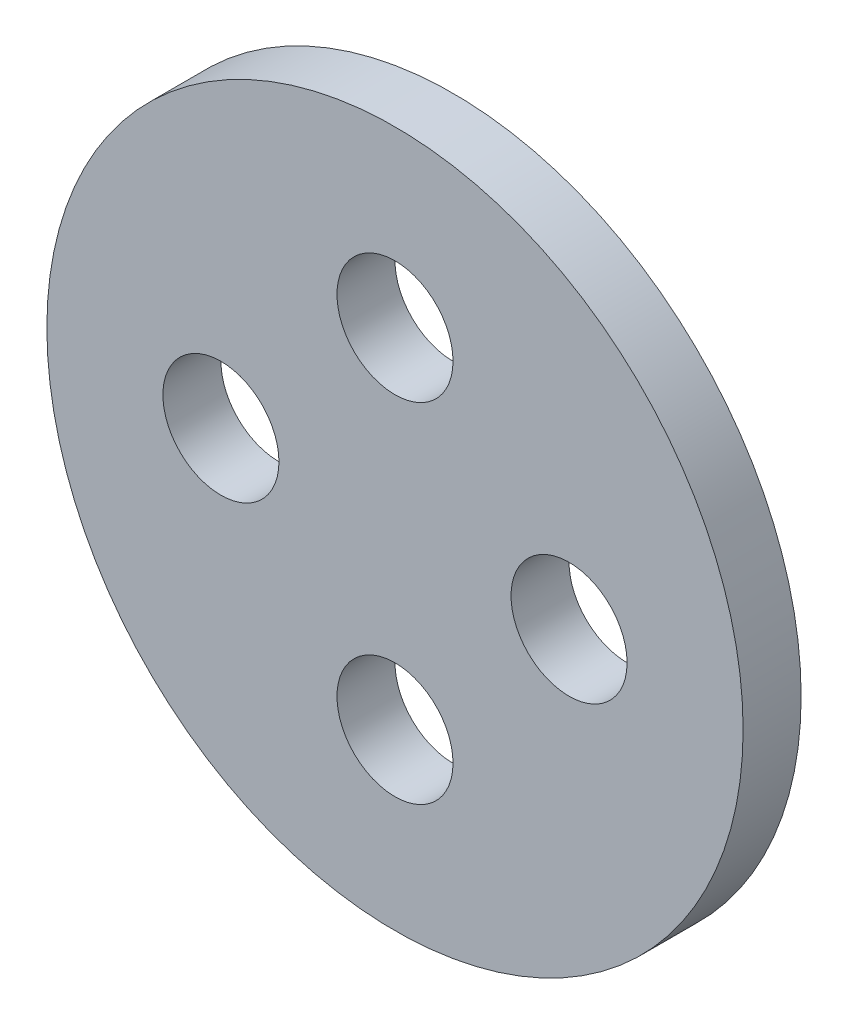
ISO-10303-21;
HEADER;
FILE_DESCRIPTION(('STEP AP214'),'2;1');
FILE_NAME('part.step','',(''),(''),'','','');
FILE_SCHEMA(('AUTOMOTIVE_DESIGN { 1 0 10303 214 1 1 1 1 }'));
ENDSEC;
DATA;
#1=APPLICATION_CONTEXT('core data for automotive mechanical design processes');
#2=APPLICATION_PROTOCOL_DEFINITION('international standard','automotive_design',2000,#1);
#3=PRODUCT_CONTEXT('',#1,'mechanical');
#4=PRODUCT('Part','Part','',(#3));
#5=PRODUCT_RELATED_PRODUCT_CATEGORY('part','',(#4));
#6=PRODUCT_DEFINITION_FORMATION('','',#4);
#7=PRODUCT_DEFINITION_CONTEXT('part definition',#1,'design');
#8=PRODUCT_DEFINITION('design','',#6,#7);
#9=PRODUCT_DEFINITION_SHAPE('','',#8);
#10=(LENGTH_UNIT() NAMED_UNIT(*) SI_UNIT(.MILLI.,.METRE.));
#11=(NAMED_UNIT(*) PLANE_ANGLE_UNIT() SI_UNIT($,.RADIAN.));
#12=(NAMED_UNIT(*) SI_UNIT($,.STERADIAN.) SOLID_ANGLE_UNIT());
#13=UNCERTAINTY_MEASURE_WITH_UNIT(LENGTH_MEASURE(1.E-05),#10,'distance_accuracy_value','');
#14=(GEOMETRIC_REPRESENTATION_CONTEXT(3) GLOBAL_UNCERTAINTY_ASSIGNED_CONTEXT((#13)) GLOBAL_UNIT_ASSIGNED_CONTEXT((#10,
#11,#12)) REPRESENTATION_CONTEXT('',''));
#15=CARTESIAN_POINT('',(0.,0.,0.));
#16=DIRECTION('',(0.,0.,1.));
#17=DIRECTION('',(1.,0.,0.));
#18=AXIS2_PLACEMENT_3D('',#15,#16,#17);
#19=CARTESIAN_POINT('',(0.,0.,1.));
#20=DIRECTION('',(0.,0.,1.));
#21=DIRECTION('',(1.,0.,0.));
#22=AXIS2_PLACEMENT_3D('',#19,#20,#21);
#23=PLANE('',#22);
#24=CARTESIAN_POINT('',(3.95699567787191E-13,-3.,1.));
#25=DIRECTION('',(0.,0.,1.));
#26=DIRECTION('',(1.,0.,0.));
#27=AXIS2_PLACEMENT_3D('',#24,#25,#26);
#28=CIRCLE('',#27,1.);
#29=CARTESIAN_POINT('',(1.0000000000004,-3.,1.));
#30=VERTEX_POINT('',#29);
#31=EDGE_CURVE('E57',#30,#30,#28,.T.);
#32=ORIENTED_EDGE('',*,*,#31,.F.);
#33=EDGE_LOOP('',(#32));
#34=FACE_BOUND('',#33,.T.);
#35=CARTESIAN_POINT('',(0.,3.,1.));
#36=DIRECTION('',(0.,0.,1.));
#37=DIRECTION('',(1.,0.,0.));
#38=AXIS2_PLACEMENT_3D('',#35,#36,#37);
#39=CIRCLE('',#38,1.);
#40=CARTESIAN_POINT('',(1.,3.,1.));
#41=VERTEX_POINT('',#40);
#42=EDGE_CURVE('E46',#41,#41,#39,.T.);
#43=ORIENTED_EDGE('',*,*,#42,.F.);
#44=EDGE_LOOP('',(#43));
#45=FACE_BOUND('',#44,.T.);
#46=CARTESIAN_POINT('',(0.,0.,1.));
#47=DIRECTION('',(0.,0.,1.));
#48=DIRECTION('',(1.,0.,0.));
#49=AXIS2_PLACEMENT_3D('',#46,#47,#48);
#50=CIRCLE('',#49,6.);
#51=CARTESIAN_POINT('',(6.,0.,1.));
#52=VERTEX_POINT('',#51);
#53=EDGE_CURVE('E10',#52,#52,#50,.T.);
#54=ORIENTED_EDGE('',*,*,#53,.T.);
#55=EDGE_LOOP('',(#54));
#56=FACE_BOUND('',#55,.T.);
#57=CARTESIAN_POINT('',(3.0000000000002,1.97849783893595E-13,1.));
#58=DIRECTION('',(0.,0.,1.));
#59=DIRECTION('',(1.,0.,0.));
#60=AXIS2_PLACEMENT_3D('',#57,#58,#59);
#61=CIRCLE('',#60,1.);
#62=CARTESIAN_POINT('',(4.0000000000002,1.97849783893595E-13,1.));
#63=VERTEX_POINT('',#62);
#64=EDGE_CURVE('E51',#63,#63,#61,.T.);
#65=ORIENTED_EDGE('',*,*,#64,.F.);
#66=EDGE_LOOP('',(#65));
#67=FACE_BOUND('',#66,.T.);
#68=CARTESIAN_POINT('',(-2.9999999999998,-1.9821717793334E-13,1.));
#69=DIRECTION('',(0.,0.,1.));
#70=DIRECTION('',(1.,0.,0.));
#71=AXIS2_PLACEMENT_3D('',#68,#69,#70);
#72=CIRCLE('',#71,1.);
#73=CARTESIAN_POINT('',(-1.9999999999998,-1.9821717793334E-13,1.));
#74=VERTEX_POINT('',#73);
#75=EDGE_CURVE('E63',#74,#74,#72,.T.);
#76=ORIENTED_EDGE('',*,*,#75,.F.);
#77=EDGE_LOOP('',(#76));
#78=FACE_BOUND('',#77,.T.);
#79=ADVANCED_FACE('F35',(#34,#45,#56,#67,#78),#23,.T.);
#80=CARTESIAN_POINT('',(0.,0.,0.));
#81=DIRECTION('',(0.,0.,1.));
#82=DIRECTION('',(1.,0.,0.));
#83=AXIS2_PLACEMENT_3D('',#80,#81,#82);
#84=PLANE('',#83);
#85=CARTESIAN_POINT('',(0.,0.,0.));
#86=DIRECTION('',(0.,0.,1.));
#87=DIRECTION('',(1.,0.,0.));
#88=AXIS2_PLACEMENT_3D('',#85,#86,#87);
#89=CIRCLE('',#88,6.);
#90=CARTESIAN_POINT('',(6.,0.,0.));
#91=VERTEX_POINT('',#90);
#92=EDGE_CURVE('E39',#91,#91,#89,.T.);
#93=ORIENTED_EDGE('',*,*,#92,.F.);
#94=EDGE_LOOP('',(#93));
#95=FACE_BOUND('',#94,.T.);
#96=CARTESIAN_POINT('',(0.,3.,0.));
#97=DIRECTION('',(0.,0.,1.));
#98=DIRECTION('',(1.,0.,0.));
#99=AXIS2_PLACEMENT_3D('',#96,#97,#98);
#100=CIRCLE('',#99,1.);
#101=CARTESIAN_POINT('',(1.,3.,0.));
#102=VERTEX_POINT('',#101);
#103=EDGE_CURVE('E48',#102,#102,#100,.T.);
#104=ORIENTED_EDGE('',*,*,#103,.T.);
#105=EDGE_LOOP('',(#104));
#106=FACE_BOUND('',#105,.T.);
#107=CARTESIAN_POINT('',(3.0000000000002,1.97849783893595E-13,0.));
#108=DIRECTION('',(0.,0.,1.));
#109=DIRECTION('',(1.,0.,0.));
#110=AXIS2_PLACEMENT_3D('',#107,#108,#109);
#111=CIRCLE('',#110,1.);
#112=CARTESIAN_POINT('',(4.0000000000002,1.97849783893595E-13,0.));
#113=VERTEX_POINT('',#112);
#114=EDGE_CURVE('E54',#113,#113,#111,.T.);
#115=ORIENTED_EDGE('',*,*,#114,.T.);
#116=EDGE_LOOP('',(#115));
#117=FACE_BOUND('',#116,.T.);
#118=CARTESIAN_POINT('',(3.95699567787191E-13,-3.,0.));
#119=DIRECTION('',(0.,0.,1.));
#120=DIRECTION('',(1.,0.,0.));
#121=AXIS2_PLACEMENT_3D('',#118,#119,#120);
#122=CIRCLE('',#121,1.);
#123=CARTESIAN_POINT('',(1.0000000000004,-3.,0.));
#124=VERTEX_POINT('',#123);
#125=EDGE_CURVE('E60',#124,#124,#122,.T.);
#126=ORIENTED_EDGE('',*,*,#125,.T.);
#127=EDGE_LOOP('',(#126));
#128=FACE_BOUND('',#127,.T.);
#129=CARTESIAN_POINT('',(-2.9999999999998,-1.9821717793334E-13,0.));
#130=DIRECTION('',(0.,0.,1.));
#131=DIRECTION('',(1.,0.,0.));
#132=AXIS2_PLACEMENT_3D('',#129,#130,#131);
#133=CIRCLE('',#132,1.);
#134=CARTESIAN_POINT('',(-1.9999999999998,-1.9821717793334E-13,0.));
#135=VERTEX_POINT('',#134);
#136=EDGE_CURVE('E66',#135,#135,#133,.T.);
#137=ORIENTED_EDGE('',*,*,#136,.T.);
#138=EDGE_LOOP('',(#137));
#139=FACE_BOUND('',#138,.T.);
#140=ADVANCED_FACE('F76',(#95,#106,#117,#128,#139),#84,.F.);
#141=CARTESIAN_POINT('',(0.,0.,1.));
#142=DIRECTION('',(0.,0.,-1.));
#143=DIRECTION('',(-1.,0.,0.));
#144=AXIS2_PLACEMENT_3D('',#141,#142,#143);
#145=CYLINDRICAL_SURFACE('',#144,6.);
#146=ORIENTED_EDGE('',*,*,#53,.F.);
#147=EDGE_LOOP('',(#146));
#148=FACE_BOUND('',#147,.T.);
#149=ORIENTED_EDGE('',*,*,#92,.T.);
#150=EDGE_LOOP('',(#149));
#151=FACE_BOUND('',#150,.T.);
#152=ADVANCED_FACE('F37',(#148,#151),#145,.T.);
#153=CARTESIAN_POINT('',(0.,3.,1.));
#154=DIRECTION('',(0.,0.,-1.));
#155=DIRECTION('',(-1.,0.,0.));
#156=AXIS2_PLACEMENT_3D('',#153,#154,#155);
#157=CYLINDRICAL_SURFACE('',#156,1.);
#158=ORIENTED_EDGE('',*,*,#42,.T.);
#159=EDGE_LOOP('',(#158));
#160=FACE_BOUND('',#159,.T.);
#161=ORIENTED_EDGE('',*,*,#103,.F.);
#162=EDGE_LOOP('',(#161));
#163=FACE_BOUND('',#162,.T.);
#164=ADVANCED_FACE('F86',(#160,#163),#157,.F.);
#165=CARTESIAN_POINT('',(3.0000000000002,1.97849783893595E-13,1.));
#166=DIRECTION('',(0.,0.,-1.));
#167=DIRECTION('',(-1.,0.,0.));
#168=AXIS2_PLACEMENT_3D('',#165,#166,#167);
#169=CYLINDRICAL_SURFACE('',#168,1.);
#170=ORIENTED_EDGE('',*,*,#64,.T.);
#171=EDGE_LOOP('',(#170));
#172=FACE_BOUND('',#171,.T.);
#173=ORIENTED_EDGE('',*,*,#114,.F.);
#174=EDGE_LOOP('',(#173));
#175=FACE_BOUND('',#174,.T.);
#176=ADVANCED_FACE('F89',(#172,#175),#169,.F.);
#177=CARTESIAN_POINT('',(3.95699567787191E-13,-3.,1.));
#178=DIRECTION('',(0.,0.,-1.));
#179=DIRECTION('',(-1.,0.,0.));
#180=AXIS2_PLACEMENT_3D('',#177,#178,#179);
#181=CYLINDRICAL_SURFACE('',#180,1.);
#182=ORIENTED_EDGE('',*,*,#31,.T.);
#183=EDGE_LOOP('',(#182));
#184=FACE_BOUND('',#183,.T.);
#185=ORIENTED_EDGE('',*,*,#125,.F.);
#186=EDGE_LOOP('',(#185));
#187=FACE_BOUND('',#186,.T.);
#188=ADVANCED_FACE('F93',(#184,#187),#181,.F.);
#189=CARTESIAN_POINT('',(-2.9999999999998,-1.9821717793334E-13,1.));
#190=DIRECTION('',(0.,0.,-1.));
#191=DIRECTION('',(-1.,0.,0.));
#192=AXIS2_PLACEMENT_3D('',#189,#190,#191);
#193=CYLINDRICAL_SURFACE('',#192,1.);
#194=ORIENTED_EDGE('',*,*,#75,.T.);
#195=EDGE_LOOP('',(#194));
#196=FACE_BOUND('',#195,.T.);
#197=ORIENTED_EDGE('',*,*,#136,.F.);
#198=EDGE_LOOP('',(#197));
#199=FACE_BOUND('',#198,.T.);
#200=ADVANCED_FACE('F72',(#196,#199),#193,.F.);
#201=CLOSED_SHELL('',(#79,#140,#152,#164,#176,#188,#200));
#202=MANIFOLD_SOLID_BREP('B2',#201);
#203=ADVANCED_BREP_SHAPE_REPRESENTATION('',(#18,#202),#14);
#204=SHAPE_DEFINITION_REPRESENTATION(#9,#203);
ENDSEC;
END-ISO-10303-21;
